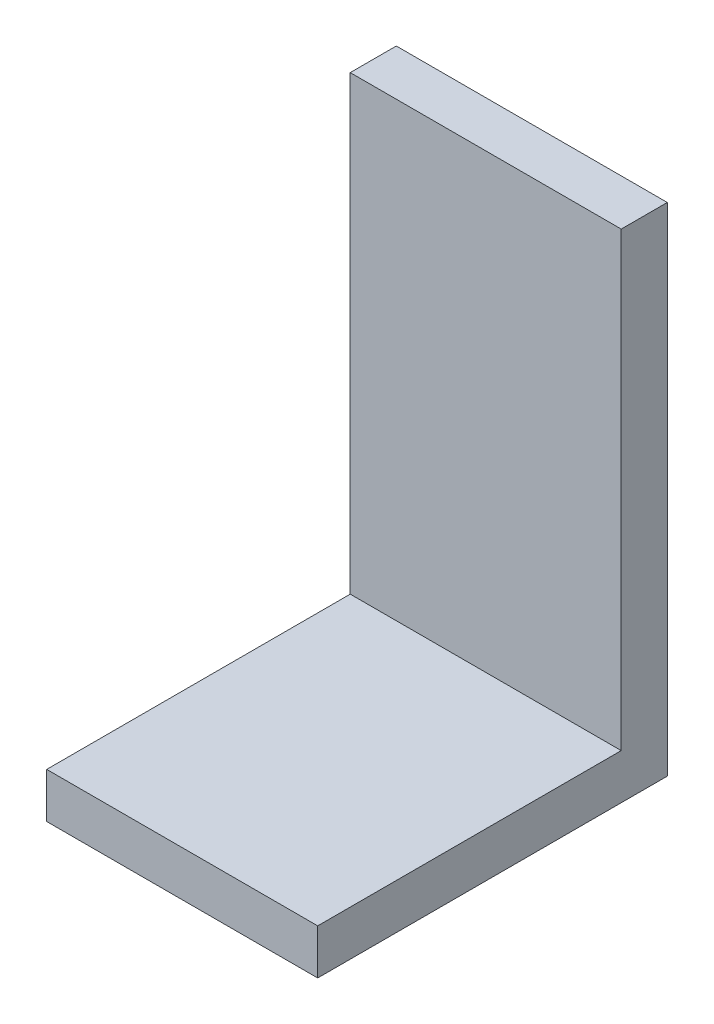
ISO-10303-21;
HEADER;
FILE_DESCRIPTION(('STEP AP214'),'2;1');
FILE_NAME('part.step','',(''),(''),'','','');
FILE_SCHEMA(('AUTOMOTIVE_DESIGN { 1 0 10303 214 1 1 1 1 }'));
ENDSEC;
DATA;
#1=APPLICATION_CONTEXT('core data for automotive mechanical design processes');
#2=APPLICATION_PROTOCOL_DEFINITION('international standard','automotive_design',2000,#1);
#3=PRODUCT_CONTEXT('',#1,'mechanical');
#4=PRODUCT('Part','Part','',(#3));
#5=PRODUCT_RELATED_PRODUCT_CATEGORY('part','',(#4));
#6=PRODUCT_DEFINITION_FORMATION('','',#4);
#7=PRODUCT_DEFINITION_CONTEXT('part definition',#1,'design');
#8=PRODUCT_DEFINITION('design','',#6,#7);
#9=PRODUCT_DEFINITION_SHAPE('','',#8);
#10=(LENGTH_UNIT() NAMED_UNIT(*) SI_UNIT(.MILLI.,.METRE.));
#11=(NAMED_UNIT(*) PLANE_ANGLE_UNIT() SI_UNIT($,.RADIAN.));
#12=(NAMED_UNIT(*) SI_UNIT($,.STERADIAN.) SOLID_ANGLE_UNIT());
#13=UNCERTAINTY_MEASURE_WITH_UNIT(LENGTH_MEASURE(1.E-05),#10,'distance_accuracy_value','');
#14=(GEOMETRIC_REPRESENTATION_CONTEXT(3) GLOBAL_UNCERTAINTY_ASSIGNED_CONTEXT((#13)) GLOBAL_UNIT_ASSIGNED_CONTEXT((#10,
#11,#12)) REPRESENTATION_CONTEXT('',''));
#15=CARTESIAN_POINT('',(0.,0.,0.));
#16=DIRECTION('',(0.,0.,1.));
#17=DIRECTION('',(1.,0.,0.));
#18=AXIS2_PLACEMENT_3D('',#15,#16,#17);
#19=CARTESIAN_POINT('',(-1.1,-4.55,0.));
#20=DIRECTION('',(1.,0.,0.));
#21=DIRECTION('',(0.,0.,1.));
#22=AXIS2_PLACEMENT_3D('',#19,#20,#21);
#23=PLANE('',#22);
#24=DIRECTION('',(0.,-1.,0.));
#25=VECTOR('',#24,1.);
#26=CARTESIAN_POINT('',(-1.1,-4.,0.));
#27=LINE('',#26,#25);
#28=CARTESIAN_POINT('',(-1.1,-4.,0.));
#29=VERTEX_POINT('',#28);
#30=CARTESIAN_POINT('',(-1.1,-4.55,0.));
#31=VERTEX_POINT('',#30);
#32=EDGE_CURVE('E11',#29,#31,#27,.T.);
#33=ORIENTED_EDGE('',*,*,#32,.F.);
#34=DIRECTION('',(0.,0.,-1.));
#35=VECTOR('',#34,1.);
#36=CARTESIAN_POINT('',(-1.1,-4.,0.051));
#37=LINE('',#36,#35);
#38=CARTESIAN_POINT('',(-1.1,-4.,0.051));
#39=VERTEX_POINT('',#38);
#40=EDGE_CURVE('E24',#39,#29,#37,.T.);
#41=ORIENTED_EDGE('',*,*,#40,.F.);
#42=DIRECTION('',(0.,1.,0.));
#43=VECTOR('',#42,1.);
#44=CARTESIAN_POINT('',(-1.1,-4.5,0.051));
#45=LINE('',#44,#43);
#46=CARTESIAN_POINT('',(-1.1,-4.5,0.051));
#47=VERTEX_POINT('',#46);
#48=EDGE_CURVE('E87',#47,#39,#45,.T.);
#49=ORIENTED_EDGE('',*,*,#48,.F.);
#50=DIRECTION('',(0.,0.,-1.));
#51=VECTOR('',#50,1.);
#52=CARTESIAN_POINT('',(-1.1,-4.5,0.387));
#53=LINE('',#52,#51);
#54=CARTESIAN_POINT('',(-1.1,-4.5,0.387));
#55=VERTEX_POINT('',#54);
#56=EDGE_CURVE('E114',#55,#47,#53,.T.);
#57=ORIENTED_EDGE('',*,*,#56,.F.);
#58=DIRECTION('',(0.,1.,0.));
#59=VECTOR('',#58,1.);
#60=CARTESIAN_POINT('',(-1.1,-4.55,0.387));
#61=LINE('',#60,#59);
#62=CARTESIAN_POINT('',(-1.1,-4.55,0.387));
#63=VERTEX_POINT('',#62);
#64=EDGE_CURVE('E111',#63,#55,#61,.T.);
#65=ORIENTED_EDGE('',*,*,#64,.F.);
#66=DIRECTION('',(0.,0.,1.));
#67=VECTOR('',#66,1.);
#68=CARTESIAN_POINT('',(-1.1,-4.55,0.));
#69=LINE('',#68,#67);
#70=EDGE_CURVE('E108',#31,#63,#69,.T.);
#71=ORIENTED_EDGE('',*,*,#70,.F.);
#72=EDGE_LOOP('',(#33,#41,#49,#57,#65,#71));
#73=FACE_BOUND('',#72,.T.);
#74=ADVANCED_FACE('F17',(#73),#23,.T.);
#75=CARTESIAN_POINT('',(-1.4,-4.,0.));
#76=DIRECTION('',(-1.,0.,0.));
#77=DIRECTION('',(0.,0.,1.));
#78=AXIS2_PLACEMENT_3D('',#75,#76,#77);
#79=PLANE('',#78);
#80=DIRECTION('',(0.,1.,0.));
#81=VECTOR('',#80,1.);
#82=CARTESIAN_POINT('',(-1.4,-4.55,0.));
#83=LINE('',#82,#81);
#84=CARTESIAN_POINT('',(-1.4,-4.55,0.));
#85=VERTEX_POINT('',#84);
#86=CARTESIAN_POINT('',(-1.4,-4.,0.));
#87=VERTEX_POINT('',#86);
#88=EDGE_CURVE('E106',#85,#87,#83,.T.);
#89=ORIENTED_EDGE('',*,*,#88,.F.);
#90=DIRECTION('',(0.,0.,-1.));
#91=VECTOR('',#90,1.);
#92=CARTESIAN_POINT('',(-1.4,-4.55,0.387));
#93=LINE('',#92,#91);
#94=CARTESIAN_POINT('',(-1.4,-4.55,0.387));
#95=VERTEX_POINT('',#94);
#96=EDGE_CURVE('E103',#95,#85,#93,.T.);
#97=ORIENTED_EDGE('',*,*,#96,.F.);
#98=DIRECTION('',(0.,-1.,0.));
#99=VECTOR('',#98,1.);
#100=CARTESIAN_POINT('',(-1.4,-4.5,0.387));
#101=LINE('',#100,#99);
#102=CARTESIAN_POINT('',(-1.4,-4.5,0.387));
#103=VERTEX_POINT('',#102);
#104=EDGE_CURVE('E100',#103,#95,#101,.T.);
#105=ORIENTED_EDGE('',*,*,#104,.F.);
#106=DIRECTION('',(0.,0.,1.));
#107=VECTOR('',#106,1.);
#108=CARTESIAN_POINT('',(-1.4,-4.5,0.051));
#109=LINE('',#108,#107);
#110=CARTESIAN_POINT('',(-1.4,-4.5,0.051));
#111=VERTEX_POINT('',#110);
#112=EDGE_CURVE('E72',#111,#103,#109,.T.);
#113=ORIENTED_EDGE('',*,*,#112,.F.);
#114=DIRECTION('',(0.,-1.,0.));
#115=VECTOR('',#114,1.);
#116=CARTESIAN_POINT('',(-1.4,-4.,0.051));
#117=LINE('',#116,#115);
#118=CARTESIAN_POINT('',(-1.4,-4.,0.051));
#119=VERTEX_POINT('',#118);
#120=EDGE_CURVE('E66',#119,#111,#117,.T.);
#121=ORIENTED_EDGE('',*,*,#120,.F.);
#122=DIRECTION('',(0.,0.,1.));
#123=VECTOR('',#122,1.);
#124=CARTESIAN_POINT('',(-1.4,-4.,0.));
#125=LINE('',#124,#123);
#126=EDGE_CURVE('E69',#87,#119,#125,.T.);
#127=ORIENTED_EDGE('',*,*,#126,.F.);
#128=EDGE_LOOP('',(#89,#97,#105,#113,#121,#127));
#129=FACE_BOUND('',#128,.T.);
#130=ADVANCED_FACE('F68',(#129),#79,.T.);
#131=CARTESIAN_POINT('',(-1.1,-4.55,0.387));
#132=DIRECTION('',(0.,0.,1.));
#133=DIRECTION('',(0.,1.,0.));
#134=AXIS2_PLACEMENT_3D('',#131,#132,#133);
#135=PLANE('',#134);
#136=ORIENTED_EDGE('',*,*,#64,.T.);
#137=DIRECTION('',(1.,0.,0.));
#138=VECTOR('',#137,1.);
#139=CARTESIAN_POINT('',(-1.4,-4.5,0.387));
#140=LINE('',#139,#138);
#141=EDGE_CURVE('E83',#103,#55,#140,.T.);
#142=ORIENTED_EDGE('',*,*,#141,.F.);
#143=ORIENTED_EDGE('',*,*,#104,.T.);
#144=DIRECTION('',(-1.,0.,0.));
#145=VECTOR('',#144,1.);
#146=CARTESIAN_POINT('',(-1.1,-4.55,0.387));
#147=LINE('',#146,#145);
#148=EDGE_CURVE('E88',#63,#95,#147,.T.);
#149=ORIENTED_EDGE('',*,*,#148,.F.);
#150=EDGE_LOOP('',(#136,#142,#143,#149));
#151=FACE_BOUND('',#150,.T.);
#152=ADVANCED_FACE('F125',(#151),#135,.T.);
#153=CARTESIAN_POINT('',(-1.1,-4.5,0.051));
#154=DIRECTION('',(0.,0.,1.));
#155=DIRECTION('',(0.,1.,0.));
#156=AXIS2_PLACEMENT_3D('',#153,#154,#155);
#157=PLANE('',#156);
#158=ORIENTED_EDGE('',*,*,#48,.T.);
#159=DIRECTION('',(1.,0.,0.));
#160=VECTOR('',#159,1.);
#161=CARTESIAN_POINT('',(-1.4,-4.,0.051));
#162=LINE('',#161,#160);
#163=EDGE_CURVE('E81',#119,#39,#162,.T.);
#164=ORIENTED_EDGE('',*,*,#163,.F.);
#165=ORIENTED_EDGE('',*,*,#120,.T.);
#166=DIRECTION('',(-1.,0.,0.));
#167=VECTOR('',#166,1.);
#168=CARTESIAN_POINT('',(-1.1,-4.5,0.051));
#169=LINE('',#168,#167);
#170=EDGE_CURVE('E89',#47,#111,#169,.T.);
#171=ORIENTED_EDGE('',*,*,#170,.F.);
#172=EDGE_LOOP('',(#158,#164,#165,#171));
#173=FACE_BOUND('',#172,.T.);
#174=ADVANCED_FACE('F86',(#173),#157,.T.);
#175=CARTESIAN_POINT('',(-1.4,-4.55,0.));
#176=DIRECTION('',(0.,-1.,0.));
#177=DIRECTION('',(0.,0.,1.));
#178=AXIS2_PLACEMENT_3D('',#175,#176,#177);
#179=PLANE('',#178);
#180=DIRECTION('',(-1.,0.,0.));
#181=VECTOR('',#180,1.);
#182=CARTESIAN_POINT('',(-1.1,-4.55,0.));
#183=LINE('',#182,#181);
#184=EDGE_CURVE('E93',#31,#85,#183,.T.);
#185=ORIENTED_EDGE('',*,*,#184,.F.);
#186=ORIENTED_EDGE('',*,*,#70,.T.);
#187=ORIENTED_EDGE('',*,*,#148,.T.);
#188=ORIENTED_EDGE('',*,*,#96,.T.);
#189=EDGE_LOOP('',(#185,#186,#187,#188));
#190=FACE_BOUND('',#189,.T.);
#191=ADVANCED_FACE('F121',(#190),#179,.T.);
#192=CARTESIAN_POINT('',(-1.1,-4.,0.));
#193=DIRECTION('',(0.,1.,0.));
#194=DIRECTION('',(0.,0.,1.));
#195=AXIS2_PLACEMENT_3D('',#192,#193,#194);
#196=PLANE('',#195);
#197=DIRECTION('',(1.,0.,0.));
#198=VECTOR('',#197,1.);
#199=CARTESIAN_POINT('',(-1.4,-4.,0.));
#200=LINE('',#199,#198);
#201=EDGE_CURVE('E82',#87,#29,#200,.T.);
#202=ORIENTED_EDGE('',*,*,#201,.F.);
#203=ORIENTED_EDGE('',*,*,#126,.T.);
#204=ORIENTED_EDGE('',*,*,#163,.T.);
#205=ORIENTED_EDGE('',*,*,#40,.T.);
#206=EDGE_LOOP('',(#202,#203,#204,#205));
#207=FACE_BOUND('',#206,.T.);
#208=ADVANCED_FACE('F80',(#207),#196,.T.);
#209=CARTESIAN_POINT('',(-1.1,-4.5,0.051));
#210=DIRECTION('',(0.,1.,0.));
#211=DIRECTION('',(0.,0.,1.));
#212=AXIS2_PLACEMENT_3D('',#209,#210,#211);
#213=PLANE('',#212);
#214=ORIENTED_EDGE('',*,*,#170,.T.);
#215=ORIENTED_EDGE('',*,*,#112,.T.);
#216=ORIENTED_EDGE('',*,*,#141,.T.);
#217=ORIENTED_EDGE('',*,*,#56,.T.);
#218=EDGE_LOOP('',(#214,#215,#216,#217));
#219=FACE_BOUND('',#218,.T.);
#220=ADVANCED_FACE('F127',(#219),#213,.T.);
#221=CARTESIAN_POINT('',(-1.4,-4.55,0.));
#222=DIRECTION('',(0.,0.,-1.));
#223=DIRECTION('',(0.,1.,0.));
#224=AXIS2_PLACEMENT_3D('',#221,#222,#223);
#225=PLANE('',#224);
#226=ORIENTED_EDGE('',*,*,#88,.T.);
#227=ORIENTED_EDGE('',*,*,#201,.T.);
#228=ORIENTED_EDGE('',*,*,#32,.T.);
#229=ORIENTED_EDGE('',*,*,#184,.T.);
#230=EDGE_LOOP('',(#226,#227,#228,#229));
#231=FACE_BOUND('',#230,.T.);
#232=ADVANCED_FACE('F117',(#231),#225,.T.);
#233=CLOSED_SHELL('',(#74,#130,#152,#174,#191,#208,#220,#232));
#234=MANIFOLD_SOLID_BREP('B1',#233);
#235=ADVANCED_BREP_SHAPE_REPRESENTATION('',(#18,#234),#14);
#236=SHAPE_DEFINITION_REPRESENTATION(#9,#235);
ENDSEC;
END-ISO-10303-21;
